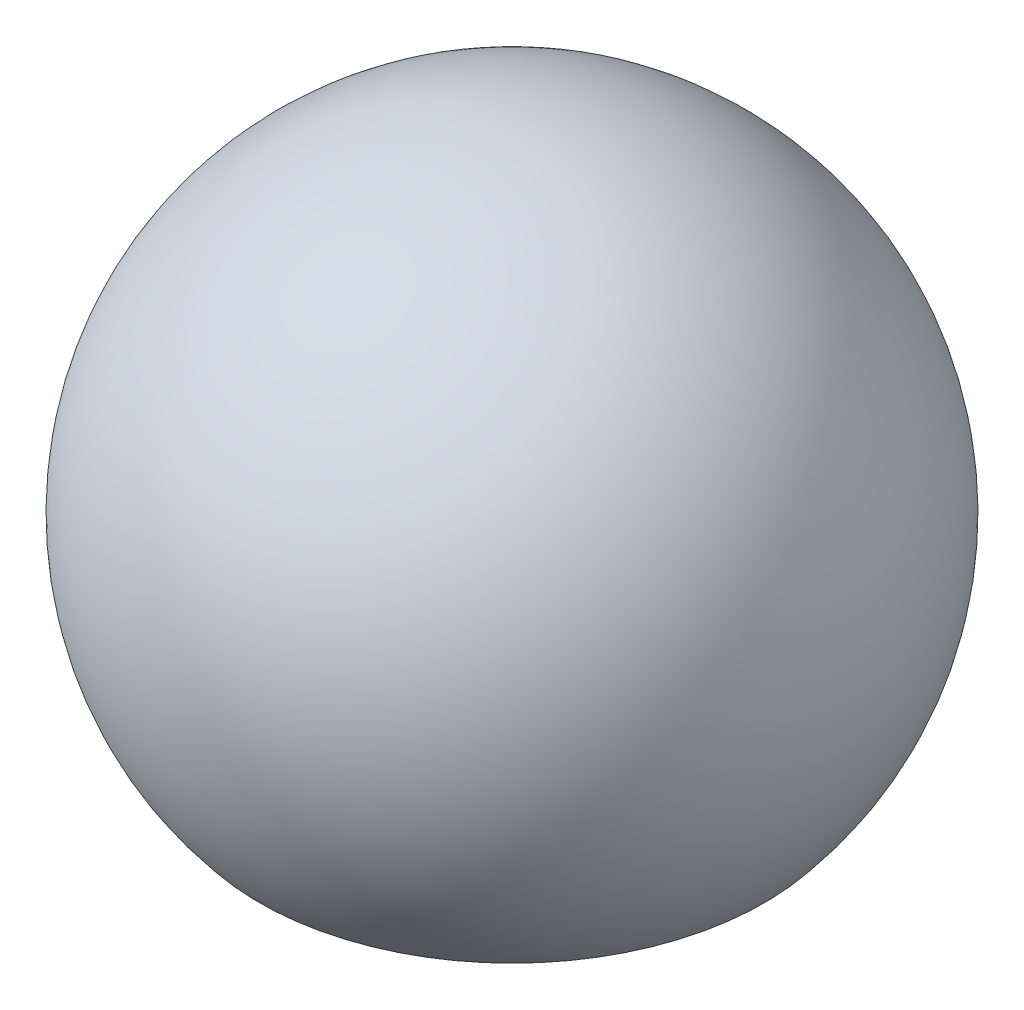
ISO-10303-21;
HEADER;
FILE_DESCRIPTION(('STEP AP214'),'2;1');
FILE_NAME('part.step','',(''),(''),'','','');
FILE_SCHEMA(('AUTOMOTIVE_DESIGN { 1 0 10303 214 1 1 1 1 }'));
ENDSEC;
DATA;
#1=APPLICATION_CONTEXT('core data for automotive mechanical design processes');
#2=APPLICATION_PROTOCOL_DEFINITION('international standard','automotive_design',2000,#1);
#3=PRODUCT_CONTEXT('',#1,'mechanical');
#4=PRODUCT('Part','Part','',(#3));
#5=PRODUCT_RELATED_PRODUCT_CATEGORY('part','',(#4));
#6=PRODUCT_DEFINITION_FORMATION('','',#4);
#7=PRODUCT_DEFINITION_CONTEXT('part definition',#1,'design');
#8=PRODUCT_DEFINITION('design','',#6,#7);
#9=PRODUCT_DEFINITION_SHAPE('','',#8);
#10=(LENGTH_UNIT() NAMED_UNIT(*) SI_UNIT(.MILLI.,.METRE.));
#11=(NAMED_UNIT(*) PLANE_ANGLE_UNIT() SI_UNIT($,.RADIAN.));
#12=(NAMED_UNIT(*) SI_UNIT($,.STERADIAN.) SOLID_ANGLE_UNIT());
#13=UNCERTAINTY_MEASURE_WITH_UNIT(LENGTH_MEASURE(1.E-05),#10,'distance_accuracy_value','');
#14=(GEOMETRIC_REPRESENTATION_CONTEXT(3) GLOBAL_UNCERTAINTY_ASSIGNED_CONTEXT((#13)) GLOBAL_UNIT_ASSIGNED_CONTEXT((#10,
#11,#12)) REPRESENTATION_CONTEXT('',''));
#15=CARTESIAN_POINT('',(0.,0.,0.));
#16=DIRECTION('',(0.,0.,1.));
#17=DIRECTION('',(1.,0.,0.));
#18=AXIS2_PLACEMENT_3D('',#15,#16,#17);
#19=CARTESIAN_POINT('',(0.,500.,0.));
#20=DIRECTION('',(0.,-1.,0.));
#21=DIRECTION('',(-1.,0.,0.));
#22=AXIS2_PLACEMENT_3D('',#19,#20,#21);
#23=SPHERICAL_SURFACE('',#22,600.);
#24=CARTESIAN_POINT('',(0.,114.327434188074,0.));
#25=DIRECTION('',(0.,-1.,0.));
#26=DIRECTION('',(0.,0.,-1.));
#27=AXIS2_PLACEMENT_3D('',#24,#25,#26);
#28=CIRCLE('',#27,459.626665871385);
#29=CARTESIAN_POINT('',(0.,114.327434188074,-459.626665871385));
#30=VERTEX_POINT('',#29);
#31=EDGE_CURVE('E10',#30,#30,#28,.T.);
#32=ORIENTED_EDGE('',*,*,#31,.T.);
#33=EDGE_LOOP('',(#32));
#34=FACE_BOUND('',#33,.T.);
#35=ADVANCED_FACE('F44',(#34),#23,.F.);
#36=CARTESIAN_POINT('',(0.,114.327434188074,0.));
#37=DIRECTION('',(0.,-1.,0.));
#38=DIRECTION('',(0.,0.,-1.));
#39=AXIS2_PLACEMENT_3D('',#36,#37,#38);
#40=CONICAL_SURFACE('',#39,459.626665871385,0.87266462599716);
#41=CARTESIAN_POINT('',(0.,-528.460175498469,0.));
#42=DIRECTION('',(0.,-1.,0.));
#43=DIRECTION('',(0.,0.,-1.));
#44=AXIS2_PLACEMENT_3D('',#41,#42,#43);
#45=CIRCLE('',#44,1225.67110899036);
#46=CARTESIAN_POINT('',(0.,-528.460175498469,-1225.67110899036));
#47=VERTEX_POINT('',#46);
#48=EDGE_CURVE('E51',#47,#47,#45,.T.);
#49=ORIENTED_EDGE('',*,*,#48,.T.);
#50=EDGE_LOOP('',(#49));
#51=FACE_BOUND('',#50,.T.);
#52=ORIENTED_EDGE('',*,*,#31,.F.);
#53=EDGE_LOOP('',(#52));
#54=FACE_BOUND('',#53,.T.);
#55=ADVANCED_FACE('F58',(#51,#54),#40,.F.);
#56=CARTESIAN_POINT('',(0.,500.,0.));
#57=DIRECTION('',(0.,-1.,0.));
#58=DIRECTION('',(-1.,0.,0.));
#59=AXIS2_PLACEMENT_3D('',#56,#57,#58);
#60=SPHERICAL_SURFACE('',#59,1600.);
#61=ORIENTED_EDGE('',*,*,#48,.F.);
#62=EDGE_LOOP('',(#61));
#63=FACE_BOUND('',#62,.T.);
#64=ADVANCED_FACE('F61',(#63),#60,.T.);
#65=CLOSED_SHELL('',(#35,#55,#64));
#66=MANIFOLD_SOLID_BREP('B2',#65);
#67=ADVANCED_BREP_SHAPE_REPRESENTATION('',(#18,#66),#14);
#68=SHAPE_DEFINITION_REPRESENTATION(#9,#67);
ENDSEC;
END-ISO-10303-21;
